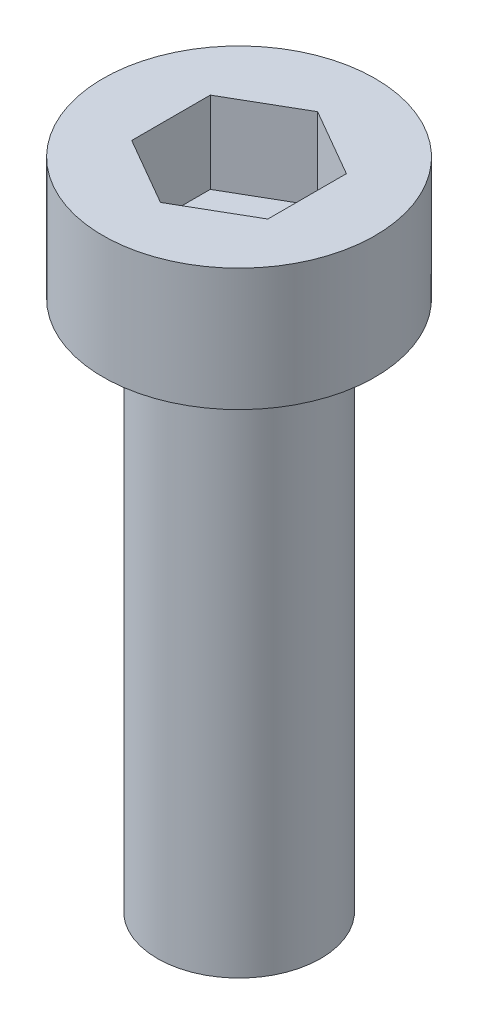
ISO-10303-21;
HEADER;
FILE_DESCRIPTION(('STEP AP214'),'2;1');
FILE_NAME('part.step','',(''),(''),'','','');
FILE_SCHEMA(('AUTOMOTIVE_DESIGN { 1 0 10303 214 1 1 1 1 }'));
ENDSEC;
DATA;
#1=APPLICATION_CONTEXT('core data for automotive mechanical design processes');
#2=APPLICATION_PROTOCOL_DEFINITION('international standard','automotive_design',2000,#1);
#3=PRODUCT_CONTEXT('',#1,'mechanical');
#4=PRODUCT('Part','Part','',(#3));
#5=PRODUCT_RELATED_PRODUCT_CATEGORY('part','',(#4));
#6=PRODUCT_DEFINITION_FORMATION('','',#4);
#7=PRODUCT_DEFINITION_CONTEXT('part definition',#1,'design');
#8=PRODUCT_DEFINITION('design','',#6,#7);
#9=PRODUCT_DEFINITION_SHAPE('','',#8);
#10=(LENGTH_UNIT() NAMED_UNIT(*) SI_UNIT(.MILLI.,.METRE.));
#11=(NAMED_UNIT(*) PLANE_ANGLE_UNIT() SI_UNIT($,.RADIAN.));
#12=(NAMED_UNIT(*) SI_UNIT($,.STERADIAN.) SOLID_ANGLE_UNIT());
#13=UNCERTAINTY_MEASURE_WITH_UNIT(LENGTH_MEASURE(1.E-05),#10,'distance_accuracy_value','');
#14=(GEOMETRIC_REPRESENTATION_CONTEXT(3) GLOBAL_UNCERTAINTY_ASSIGNED_CONTEXT((#13)) GLOBAL_UNIT_ASSIGNED_CONTEXT((#10,
#11,#12)) REPRESENTATION_CONTEXT('',''));
#15=CARTESIAN_POINT('',(0.,0.,0.));
#16=DIRECTION('',(0.,0.,1.));
#17=DIRECTION('',(1.,0.,0.));
#18=AXIS2_PLACEMENT_3D('',#15,#16,#17);
#19=CARTESIAN_POINT('',(0.,0.,0.));
#20=DIRECTION('',(0.,1.,0.));
#21=DIRECTION('',(0.,0.,1.));
#22=AXIS2_PLACEMENT_3D('',#19,#20,#21);
#23=PLANE('',#22);
#24=DIRECTION('',(-0.866025403784439,0.,-0.5));
#25=VECTOR('',#24,1.);
#26=CARTESIAN_POINT('',(2.5,0.,-1.44337567297407));
#27=LINE('',#26,#25);
#28=CARTESIAN_POINT('',(2.5,0.,-1.44337567297407));
#29=VERTEX_POINT('',#28);
#30=CARTESIAN_POINT('',(0.,0.,-2.88675134594813));
#31=VERTEX_POINT('',#30);
#32=EDGE_CURVE('E49',#29,#31,#27,.T.);
#33=ORIENTED_EDGE('',*,*,#32,.F.);
#34=DIRECTION('',(0.,0.,-1.));
#35=VECTOR('',#34,1.);
#36=CARTESIAN_POINT('',(2.5,0.,1.44337567297406));
#37=LINE('',#36,#35);
#38=CARTESIAN_POINT('',(2.5,0.,1.44337567297406));
#39=VERTEX_POINT('',#38);
#40=EDGE_CURVE('E132',#39,#29,#37,.T.);
#41=ORIENTED_EDGE('',*,*,#40,.F.);
#42=DIRECTION('',(0.866025403784439,0.,-0.5));
#43=VECTOR('',#42,1.);
#44=CARTESIAN_POINT('',(0.,0.,2.88675134594813));
#45=LINE('',#44,#43);
#46=CARTESIAN_POINT('',(0.,0.,2.88675134594813));
#47=VERTEX_POINT('',#46);
#48=EDGE_CURVE('E130',#47,#39,#45,.T.);
#49=ORIENTED_EDGE('',*,*,#48,.F.);
#50=DIRECTION('',(0.866025403784439,0.,0.5));
#51=VECTOR('',#50,1.);
#52=CARTESIAN_POINT('',(-2.5,0.,1.44337567297407));
#53=LINE('',#52,#51);
#54=CARTESIAN_POINT('',(-2.5,0.,1.44337567297407));
#55=VERTEX_POINT('',#54);
#56=EDGE_CURVE('E97',#55,#47,#53,.T.);
#57=ORIENTED_EDGE('',*,*,#56,.F.);
#58=DIRECTION('',(0.,0.,1.));
#59=VECTOR('',#58,1.);
#60=CARTESIAN_POINT('',(-2.5,0.,-1.44337567297406));
#61=LINE('',#60,#59);
#62=CARTESIAN_POINT('',(-2.5,0.,-1.44337567297406));
#63=VERTEX_POINT('',#62);
#64=EDGE_CURVE('E126',#63,#55,#61,.T.);
#65=ORIENTED_EDGE('',*,*,#64,.F.);
#66=DIRECTION('',(-0.866025403784439,0.,0.5));
#67=VECTOR('',#66,1.);
#68=CARTESIAN_POINT('',(0.,0.,-2.88675134594813));
#69=LINE('',#68,#67);
#70=EDGE_CURVE('E123',#31,#63,#69,.T.);
#71=ORIENTED_EDGE('',*,*,#70,.F.);
#72=EDGE_LOOP('',(#33,#41,#49,#57,#65,#71));
#73=FACE_BOUND('',#72,.T.);
#74=CARTESIAN_POINT('',(0.,0.,0.));
#75=DIRECTION('',(0.,-1.,0.));
#76=DIRECTION('',(0.,0.,-1.));
#77=AXIS2_PLACEMENT_3D('',#74,#75,#76);
#78=CIRCLE('',#77,5.);
#79=CARTESIAN_POINT('',(0.,0.,-5.));
#80=VERTEX_POINT('',#79);
#81=EDGE_CURVE('E11',#80,#80,#78,.T.);
#82=ORIENTED_EDGE('',*,*,#81,.F.);
#83=EDGE_LOOP('',(#82));
#84=FACE_BOUND('',#83,.T.);
#85=ADVANCED_FACE('F35',(#73,#84),#23,.T.);
#86=CARTESIAN_POINT('',(0.,0.,0.));
#87=DIRECTION('',(0.,-1.,0.));
#88=DIRECTION('',(0.,0.,-1.));
#89=AXIS2_PLACEMENT_3D('',#86,#87,#88);
#90=CYLINDRICAL_SURFACE('',#89,5.);
#91=ORIENTED_EDGE('',*,*,#81,.T.);
#92=EDGE_LOOP('',(#91));
#93=FACE_BOUND('',#92,.T.);
#94=CARTESIAN_POINT('',(0.,-4.5,0.));
#95=DIRECTION('',(0.,-1.,0.));
#96=DIRECTION('',(0.,0.,-1.));
#97=AXIS2_PLACEMENT_3D('',#94,#95,#96);
#98=CIRCLE('',#97,5.);
#99=CARTESIAN_POINT('',(0.,-4.5,-5.));
#100=VERTEX_POINT('',#99);
#101=EDGE_CURVE('E42',#100,#100,#98,.T.);
#102=ORIENTED_EDGE('',*,*,#101,.F.);
#103=EDGE_LOOP('',(#102));
#104=FACE_BOUND('',#103,.T.);
#105=ADVANCED_FACE('F152',(#93,#104),#90,.T.);
#106=CARTESIAN_POINT('',(5.,-4.5,0.));
#107=DIRECTION('',(0.,-1.,0.));
#108=DIRECTION('',(0.,0.,-1.));
#109=AXIS2_PLACEMENT_3D('',#106,#107,#108);
#110=PLANE('',#109);
#111=ORIENTED_EDGE('',*,*,#101,.T.);
#112=EDGE_LOOP('',(#111));
#113=FACE_BOUND('',#112,.T.);
#114=CARTESIAN_POINT('',(0.,-4.5,0.));
#115=DIRECTION('',(0.,-1.,0.));
#116=DIRECTION('',(0.,0.,-1.));
#117=AXIS2_PLACEMENT_3D('',#114,#115,#116);
#118=CIRCLE('',#117,3.);
#119=CARTESIAN_POINT('',(0.,-4.5,-3.));
#120=VERTEX_POINT('',#119);
#121=EDGE_CURVE('E144',#120,#120,#118,.T.);
#122=ORIENTED_EDGE('',*,*,#121,.F.);
#123=EDGE_LOOP('',(#122));
#124=FACE_BOUND('',#123,.T.);
#125=ADVANCED_FACE('F149',(#113,#124),#110,.T.);
#126=CARTESIAN_POINT('',(0.,0.,0.));
#127=DIRECTION('',(0.,-1.,0.));
#128=DIRECTION('',(0.,0.,-1.));
#129=AXIS2_PLACEMENT_3D('',#126,#127,#128);
#130=CYLINDRICAL_SURFACE('',#129,3.);
#131=ORIENTED_EDGE('',*,*,#121,.T.);
#132=EDGE_LOOP('',(#131));
#133=FACE_BOUND('',#132,.T.);
#134=CARTESIAN_POINT('',(0.,-24.,0.));
#135=DIRECTION('',(0.,-1.,0.));
#136=DIRECTION('',(0.,0.,-1.));
#137=AXIS2_PLACEMENT_3D('',#134,#135,#136);
#138=CIRCLE('',#137,3.);
#139=CARTESIAN_POINT('',(0.,-24.,-3.));
#140=VERTEX_POINT('',#139);
#141=EDGE_CURVE('E136',#140,#140,#138,.T.);
#142=ORIENTED_EDGE('',*,*,#141,.F.);
#143=EDGE_LOOP('',(#142));
#144=FACE_BOUND('',#143,.T.);
#145=ADVANCED_FACE('F159',(#133,#144),#130,.T.);
#146=CARTESIAN_POINT('',(2.50000000000001,-24.,0.));
#147=DIRECTION('',(0.,-1.,0.));
#148=DIRECTION('',(0.,0.,-1.));
#149=AXIS2_PLACEMENT_3D('',#146,#147,#148);
#150=PLANE('',#149);
#151=ORIENTED_EDGE('',*,*,#141,.T.);
#152=EDGE_LOOP('',(#151));
#153=FACE_BOUND('',#152,.T.);
#154=ADVANCED_FACE('F165',(#153),#150,.T.);
#155=CARTESIAN_POINT('',(2.5,-3.,-1.44337567297407));
#156=DIRECTION('',(0.5,0.,-0.866025403784439));
#157=DIRECTION('',(-0.866025403784439,0.,-0.5));
#158=AXIS2_PLACEMENT_3D('',#155,#156,#157);
#159=PLANE('',#158);
#160=ORIENTED_EDGE('',*,*,#32,.T.);
#161=DIRECTION('',(0.,1.,0.));
#162=VECTOR('',#161,1.);
#163=CARTESIAN_POINT('',(0.,-3.,-2.88675134594813));
#164=LINE('',#163,#162);
#165=CARTESIAN_POINT('',(0.,-3.,-2.88675134594813));
#166=VERTEX_POINT('',#165);
#167=EDGE_CURVE('E79',#166,#31,#164,.T.);
#168=ORIENTED_EDGE('',*,*,#167,.F.);
#169=DIRECTION('',(-0.866025403784439,0.,-0.5));
#170=VECTOR('',#169,1.);
#171=CARTESIAN_POINT('',(2.5,-3.,-1.44337567297407));
#172=LINE('',#171,#170);
#173=CARTESIAN_POINT('',(2.5,-3.,-1.44337567297407));
#174=VERTEX_POINT('',#173);
#175=EDGE_CURVE('E134',#174,#166,#172,.T.);
#176=ORIENTED_EDGE('',*,*,#175,.F.);
#177=DIRECTION('',(0.,1.,0.));
#178=VECTOR('',#177,1.);
#179=CARTESIAN_POINT('',(2.5,-3.,-1.44337567297407));
#180=LINE('',#179,#178);
#181=EDGE_CURVE('E57',#174,#29,#180,.T.);
#182=ORIENTED_EDGE('',*,*,#181,.T.);
#183=EDGE_LOOP('',(#160,#168,#176,#182));
#184=FACE_BOUND('',#183,.T.);
#185=ADVANCED_FACE('F169',(#184),#159,.F.);
#186=CARTESIAN_POINT('',(2.5,-3.,1.44337567297406));
#187=DIRECTION('',(1.,0.,0.));
#188=DIRECTION('',(0.,0.,-1.));
#189=AXIS2_PLACEMENT_3D('',#186,#187,#188);
#190=PLANE('',#189);
#191=ORIENTED_EDGE('',*,*,#40,.T.);
#192=ORIENTED_EDGE('',*,*,#181,.F.);
#193=DIRECTION('',(0.,0.,-1.));
#194=VECTOR('',#193,1.);
#195=CARTESIAN_POINT('',(2.5,-3.,1.44337567297406));
#196=LINE('',#195,#194);
#197=CARTESIAN_POINT('',(2.5,-3.,1.44337567297406));
#198=VERTEX_POINT('',#197);
#199=EDGE_CURVE('E109',#198,#174,#196,.T.);
#200=ORIENTED_EDGE('',*,*,#199,.F.);
#201=DIRECTION('',(0.,1.,0.));
#202=VECTOR('',#201,1.);
#203=CARTESIAN_POINT('',(2.5,-3.,1.44337567297406));
#204=LINE('',#203,#202);
#205=EDGE_CURVE('E101',#198,#39,#204,.T.);
#206=ORIENTED_EDGE('',*,*,#205,.T.);
#207=EDGE_LOOP('',(#191,#192,#200,#206));
#208=FACE_BOUND('',#207,.T.);
#209=ADVANCED_FACE('F173',(#208),#190,.F.);
#210=CARTESIAN_POINT('',(0.,-3.,2.88675134594813));
#211=DIRECTION('',(0.5,0.,0.866025403784439));
#212=DIRECTION('',(0.866025403784439,0.,-0.5));
#213=AXIS2_PLACEMENT_3D('',#210,#211,#212);
#214=PLANE('',#213);
#215=ORIENTED_EDGE('',*,*,#48,.T.);
#216=ORIENTED_EDGE('',*,*,#205,.F.);
#217=DIRECTION('',(0.866025403784439,0.,-0.5));
#218=VECTOR('',#217,1.);
#219=CARTESIAN_POINT('',(0.,-3.,2.88675134594813));
#220=LINE('',#219,#218);
#221=CARTESIAN_POINT('',(0.,-3.,2.88675134594813));
#222=VERTEX_POINT('',#221);
#223=EDGE_CURVE('E105',#222,#198,#220,.T.);
#224=ORIENTED_EDGE('',*,*,#223,.F.);
#225=DIRECTION('',(0.,1.,0.));
#226=VECTOR('',#225,1.);
#227=CARTESIAN_POINT('',(0.,-3.,2.88675134594813));
#228=LINE('',#227,#226);
#229=EDGE_CURVE('E90',#222,#47,#228,.T.);
#230=ORIENTED_EDGE('',*,*,#229,.T.);
#231=EDGE_LOOP('',(#215,#216,#224,#230));
#232=FACE_BOUND('',#231,.T.);
#233=ADVANCED_FACE('F106',(#232),#214,.F.);
#234=CARTESIAN_POINT('',(-2.5,-3.,1.44337567297407));
#235=DIRECTION('',(-0.5,0.,0.866025403784439));
#236=DIRECTION('',(0.866025403784439,0.,0.5));
#237=AXIS2_PLACEMENT_3D('',#234,#235,#236);
#238=PLANE('',#237);
#239=ORIENTED_EDGE('',*,*,#56,.T.);
#240=ORIENTED_EDGE('',*,*,#229,.F.);
#241=DIRECTION('',(0.866025403784439,0.,0.5));
#242=VECTOR('',#241,1.);
#243=CARTESIAN_POINT('',(-2.5,-3.,1.44337567297407));
#244=LINE('',#243,#242);
#245=CARTESIAN_POINT('',(-2.5,-3.,1.44337567297407));
#246=VERTEX_POINT('',#245);
#247=EDGE_CURVE('E94',#246,#222,#244,.T.);
#248=ORIENTED_EDGE('',*,*,#247,.F.);
#249=DIRECTION('',(0.,1.,0.));
#250=VECTOR('',#249,1.);
#251=CARTESIAN_POINT('',(-2.5,-3.,1.44337567297407));
#252=LINE('',#251,#250);
#253=EDGE_CURVE('E102',#246,#55,#252,.T.);
#254=ORIENTED_EDGE('',*,*,#253,.T.);
#255=EDGE_LOOP('',(#239,#240,#248,#254));
#256=FACE_BOUND('',#255,.T.);
#257=ADVANCED_FACE('F92',(#256),#238,.F.);
#258=CARTESIAN_POINT('',(-2.5,-3.,-1.44337567297406));
#259=DIRECTION('',(-1.,0.,0.));
#260=DIRECTION('',(0.,0.,1.));
#261=AXIS2_PLACEMENT_3D('',#258,#259,#260);
#262=PLANE('',#261);
#263=ORIENTED_EDGE('',*,*,#64,.T.);
#264=ORIENTED_EDGE('',*,*,#253,.F.);
#265=DIRECTION('',(0.,0.,1.));
#266=VECTOR('',#265,1.);
#267=CARTESIAN_POINT('',(-2.5,-3.,-1.44337567297406));
#268=LINE('',#267,#266);
#269=CARTESIAN_POINT('',(-2.5,-3.,-1.44337567297406));
#270=VERTEX_POINT('',#269);
#271=EDGE_CURVE('E115',#270,#246,#268,.T.);
#272=ORIENTED_EDGE('',*,*,#271,.F.);
#273=DIRECTION('',(0.,1.,0.));
#274=VECTOR('',#273,1.);
#275=CARTESIAN_POINT('',(-2.5,-3.,-1.44337567297406));
#276=LINE('',#275,#274);
#277=EDGE_CURVE('E139',#270,#63,#276,.T.);
#278=ORIENTED_EDGE('',*,*,#277,.T.);
#279=EDGE_LOOP('',(#263,#264,#272,#278));
#280=FACE_BOUND('',#279,.T.);
#281=ADVANCED_FACE('F177',(#280),#262,.F.);
#282=CARTESIAN_POINT('',(0.,-3.,-2.88675134594813));
#283=DIRECTION('',(-0.5,0.,-0.866025403784439));
#284=DIRECTION('',(-0.866025403784439,0.,0.5));
#285=AXIS2_PLACEMENT_3D('',#282,#283,#284);
#286=PLANE('',#285);
#287=ORIENTED_EDGE('',*,*,#70,.T.);
#288=ORIENTED_EDGE('',*,*,#277,.F.);
#289=DIRECTION('',(-0.866025403784439,0.,0.5));
#290=VECTOR('',#289,1.);
#291=CARTESIAN_POINT('',(0.,-3.,-2.88675134594813));
#292=LINE('',#291,#290);
#293=EDGE_CURVE('E117',#166,#270,#292,.T.);
#294=ORIENTED_EDGE('',*,*,#293,.F.);
#295=ORIENTED_EDGE('',*,*,#167,.T.);
#296=EDGE_LOOP('',(#287,#288,#294,#295));
#297=FACE_BOUND('',#296,.T.);
#298=ADVANCED_FACE('F174',(#297),#286,.F.);
#299=CARTESIAN_POINT('',(0.,-3.,0.));
#300=DIRECTION('',(0.,1.,0.));
#301=DIRECTION('',(0.,0.,1.));
#302=AXIS2_PLACEMENT_3D('',#299,#300,#301);
#303=PLANE('',#302);
#304=ORIENTED_EDGE('',*,*,#175,.T.);
#305=ORIENTED_EDGE('',*,*,#293,.T.);
#306=ORIENTED_EDGE('',*,*,#271,.T.);
#307=ORIENTED_EDGE('',*,*,#247,.T.);
#308=ORIENTED_EDGE('',*,*,#223,.T.);
#309=ORIENTED_EDGE('',*,*,#199,.T.);
#310=EDGE_LOOP('',(#304,#305,#306,#307,#308,#309));
#311=FACE_BOUND('',#310,.T.);
#312=ADVANCED_FACE('F112',(#311),#303,.T.);
#313=CLOSED_SHELL('',(#85,#105,#125,#145,#154,#185,#209,#233,#257,#281,#298,#312));
#314=MANIFOLD_SOLID_BREP('B2',#313);
#315=ADVANCED_BREP_SHAPE_REPRESENTATION('',(#18,#314),#14);
#316=SHAPE_DEFINITION_REPRESENTATION(#9,#315);
ENDSEC;
END-ISO-10303-21;
